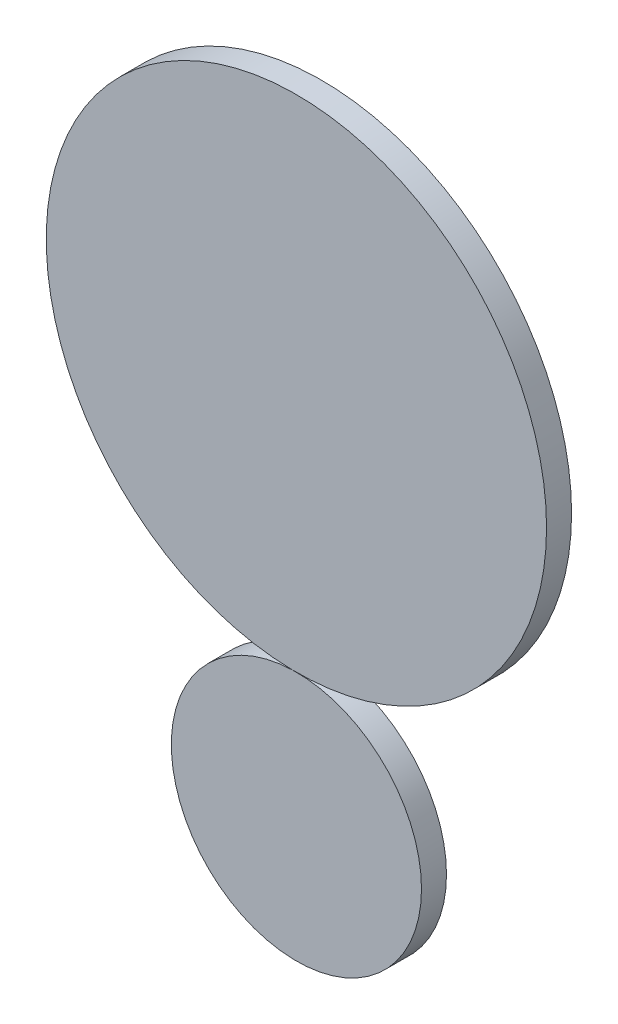
ISO-10303-21;
HEADER;
FILE_DESCRIPTION(('STEP AP214'),'2;1');
FILE_NAME('part.step','',(''),(''),'','','');
FILE_SCHEMA(('AUTOMOTIVE_DESIGN { 1 0 10303 214 1 1 1 1 }'));
ENDSEC;
DATA;
#1=APPLICATION_CONTEXT('core data for automotive mechanical design processes');
#2=APPLICATION_PROTOCOL_DEFINITION('international standard','automotive_design',2000,#1);
#3=PRODUCT_CONTEXT('',#1,'mechanical');
#4=PRODUCT('Part','Part','',(#3));
#5=PRODUCT_RELATED_PRODUCT_CATEGORY('part','',(#4));
#6=PRODUCT_DEFINITION_FORMATION('','',#4);
#7=PRODUCT_DEFINITION_CONTEXT('part definition',#1,'design');
#8=PRODUCT_DEFINITION('design','',#6,#7);
#9=PRODUCT_DEFINITION_SHAPE('','',#8);
#10=(LENGTH_UNIT() NAMED_UNIT(*) SI_UNIT(.MILLI.,.METRE.));
#11=(NAMED_UNIT(*) PLANE_ANGLE_UNIT() SI_UNIT($,.RADIAN.));
#12=(NAMED_UNIT(*) SI_UNIT($,.STERADIAN.) SOLID_ANGLE_UNIT());
#13=UNCERTAINTY_MEASURE_WITH_UNIT(LENGTH_MEASURE(1.E-05),#10,'distance_accuracy_value','');
#14=(GEOMETRIC_REPRESENTATION_CONTEXT(3) GLOBAL_UNCERTAINTY_ASSIGNED_CONTEXT((#13)) GLOBAL_UNIT_ASSIGNED_CONTEXT((#10,
#11,#12)) REPRESENTATION_CONTEXT('',''));
#15=CARTESIAN_POINT('',(0.,0.,0.));
#16=DIRECTION('',(0.,0.,1.));
#17=DIRECTION('',(1.,0.,0.));
#18=AXIS2_PLACEMENT_3D('',#15,#16,#17);
#19=CARTESIAN_POINT('',(0.,0.,2.54));
#20=DIRECTION('',(0.,0.,-1.));
#21=DIRECTION('',(-1.,0.,0.));
#22=AXIS2_PLACEMENT_3D('',#19,#20,#21);
#23=CYLINDRICAL_SURFACE('',#22,12.7);
#24=CARTESIAN_POINT('',(0.,0.,2.54));
#25=DIRECTION('',(0.,0.,1.));
#26=DIRECTION('',(1.,0.,0.));
#27=AXIS2_PLACEMENT_3D('',#24,#25,#26);
#28=CIRCLE('',#27,12.7);
#29=CARTESIAN_POINT('',(12.7,0.,2.54));
#30=VERTEX_POINT('',#29);
#31=EDGE_CURVE('E12',#30,#30,#28,.T.);
#32=ORIENTED_EDGE('',*,*,#31,.F.);
#33=EDGE_LOOP('',(#32));
#34=FACE_BOUND('',#33,.T.);
#35=CARTESIAN_POINT('',(0.,0.,0.));
#36=DIRECTION('',(0.,0.,1.));
#37=DIRECTION('',(1.,0.,0.));
#38=AXIS2_PLACEMENT_3D('',#35,#36,#37);
#39=CIRCLE('',#38,12.7);
#40=CARTESIAN_POINT('',(12.7,0.,0.));
#41=VERTEX_POINT('',#40);
#42=EDGE_CURVE('E48',#41,#41,#39,.T.);
#43=ORIENTED_EDGE('',*,*,#42,.T.);
#44=EDGE_LOOP('',(#43));
#45=FACE_BOUND('',#44,.T.);
#46=ADVANCED_FACE('F45',(#34,#45),#23,.T.);
#47=CARTESIAN_POINT('',(0.,0.,2.54));
#48=DIRECTION('',(0.,0.,1.));
#49=DIRECTION('',(1.,0.,0.));
#50=AXIS2_PLACEMENT_3D('',#47,#48,#49);
#51=PLANE('',#50);
#52=ORIENTED_EDGE('',*,*,#31,.T.);
#53=EDGE_LOOP('',(#52));
#54=FACE_BOUND('',#53,.T.);
#55=ADVANCED_FACE('F60',(#54),#51,.T.);
#56=CARTESIAN_POINT('',(0.,0.,0.));
#57=DIRECTION('',(0.,0.,1.));
#58=DIRECTION('',(1.,0.,0.));
#59=AXIS2_PLACEMENT_3D('',#56,#57,#58);
#60=PLANE('',#59);
#61=ORIENTED_EDGE('',*,*,#42,.F.);
#62=EDGE_LOOP('',(#61));
#63=FACE_BOUND('',#62,.T.);
#64=ADVANCED_FACE('F58',(#63),#60,.F.);
#65=CLOSED_SHELL('',(#46,#55,#64));
#66=MANIFOLD_SOLID_BREP('B2',#65);
#67=CARTESIAN_POINT('',(0.,38.1,2.54));
#68=DIRECTION('',(0.,0.,-1.));
#69=DIRECTION('',(-1.,0.,0.));
#70=AXIS2_PLACEMENT_3D('',#67,#68,#69);
#71=CYLINDRICAL_SURFACE('',#70,25.4);
#72=CARTESIAN_POINT('',(0.,38.1,2.54));
#73=DIRECTION('',(0.,0.,1.));
#74=DIRECTION('',(1.,0.,0.));
#75=AXIS2_PLACEMENT_3D('',#72,#73,#74);
#76=CIRCLE('',#75,25.4);
#77=CARTESIAN_POINT('',(25.4,38.1,2.54));
#78=VERTEX_POINT('',#77);
#79=EDGE_CURVE('E44',#78,#78,#76,.T.);
#80=ORIENTED_EDGE('',*,*,#79,.F.);
#81=EDGE_LOOP('',(#80));
#82=FACE_BOUND('',#81,.T.);
#83=CARTESIAN_POINT('',(0.,38.1,0.));
#84=DIRECTION('',(0.,0.,1.));
#85=DIRECTION('',(1.,0.,0.));
#86=AXIS2_PLACEMENT_3D('',#83,#84,#85);
#87=CIRCLE('',#86,25.4);
#88=CARTESIAN_POINT('',(25.4,38.1,0.));
#89=VERTEX_POINT('',#88);
#90=EDGE_CURVE('E89',#89,#89,#87,.T.);
#91=ORIENTED_EDGE('',*,*,#90,.T.);
#92=EDGE_LOOP('',(#91));
#93=FACE_BOUND('',#92,.T.);
#94=ADVANCED_FACE('F86',(#82,#93),#71,.T.);
#95=CARTESIAN_POINT('',(0.,0.,2.54));
#96=DIRECTION('',(0.,0.,1.));
#97=DIRECTION('',(1.,0.,0.));
#98=AXIS2_PLACEMENT_3D('',#95,#96,#97);
#99=PLANE('',#98);
#100=ORIENTED_EDGE('',*,*,#79,.T.);
#101=EDGE_LOOP('',(#100));
#102=FACE_BOUND('',#101,.T.);
#103=ADVANCED_FACE('F101',(#102),#99,.T.);
#104=CARTESIAN_POINT('',(0.,0.,0.));
#105=DIRECTION('',(0.,0.,1.));
#106=DIRECTION('',(1.,0.,0.));
#107=AXIS2_PLACEMENT_3D('',#104,#105,#106);
#108=PLANE('',#107);
#109=ORIENTED_EDGE('',*,*,#90,.F.);
#110=EDGE_LOOP('',(#109));
#111=FACE_BOUND('',#110,.T.);
#112=ADVANCED_FACE('F99',(#111),#108,.F.);
#113=CLOSED_SHELL('',(#94,#103,#112));
#114=MANIFOLD_SOLID_BREP('B7',#113);
#115=ADVANCED_BREP_SHAPE_REPRESENTATION('',(#18,#66,#114),#14);
#116=SHAPE_DEFINITION_REPRESENTATION(#9,#115);
ENDSEC;
END-ISO-10303-21;
